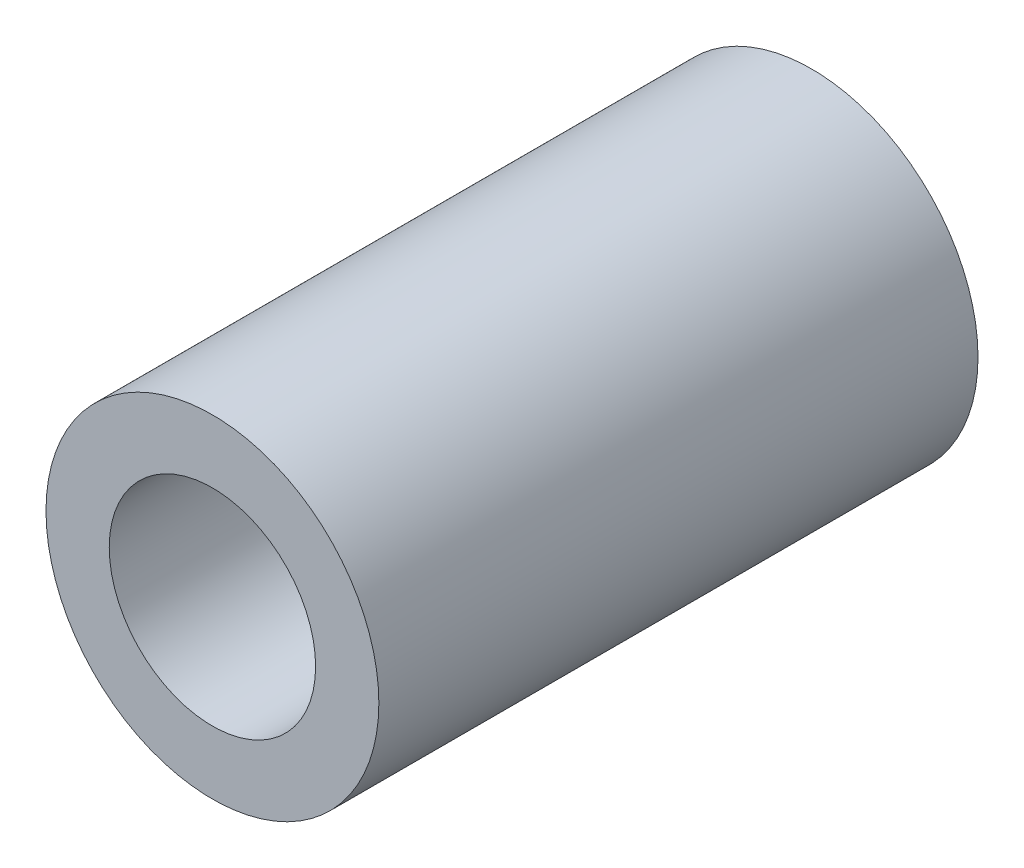
ISO-10303-21;
HEADER;
FILE_DESCRIPTION(('STEP AP214'),'2;1');
FILE_NAME('part.step','',(''),(''),'','','');
FILE_SCHEMA(('AUTOMOTIVE_DESIGN { 1 0 10303 214 1 1 1 1 }'));
ENDSEC;
DATA;
#1=APPLICATION_CONTEXT('core data for automotive mechanical design processes');
#2=APPLICATION_PROTOCOL_DEFINITION('international standard','automotive_design',2000,#1);
#3=PRODUCT_CONTEXT('',#1,'mechanical');
#4=PRODUCT('Part','Part','',(#3));
#5=PRODUCT_RELATED_PRODUCT_CATEGORY('part','',(#4));
#6=PRODUCT_DEFINITION_FORMATION('','',#4);
#7=PRODUCT_DEFINITION_CONTEXT('part definition',#1,'design');
#8=PRODUCT_DEFINITION('design','',#6,#7);
#9=PRODUCT_DEFINITION_SHAPE('','',#8);
#10=(LENGTH_UNIT() NAMED_UNIT(*) SI_UNIT(.MILLI.,.METRE.));
#11=(NAMED_UNIT(*) PLANE_ANGLE_UNIT() SI_UNIT($,.RADIAN.));
#12=(NAMED_UNIT(*) SI_UNIT($,.STERADIAN.) SOLID_ANGLE_UNIT());
#13=UNCERTAINTY_MEASURE_WITH_UNIT(LENGTH_MEASURE(1.E-05),#10,'distance_accuracy_value','');
#14=(GEOMETRIC_REPRESENTATION_CONTEXT(3) GLOBAL_UNCERTAINTY_ASSIGNED_CONTEXT((#13)) GLOBAL_UNIT_ASSIGNED_CONTEXT((#10,
#11,#12)) REPRESENTATION_CONTEXT('',''));
#15=CARTESIAN_POINT('',(0.,0.,0.));
#16=DIRECTION('',(0.,0.,1.));
#17=DIRECTION('',(1.,0.,0.));
#18=AXIS2_PLACEMENT_3D('',#15,#16,#17);
#19=CARTESIAN_POINT('',(0.,0.,9.));
#20=DIRECTION('',(0.,0.,1.));
#21=DIRECTION('',(1.,0.,0.));
#22=AXIS2_PLACEMENT_3D('',#19,#20,#21);
#23=PLANE('',#22);
#24=CARTESIAN_POINT('',(0.,0.,9.));
#25=DIRECTION('',(0.,0.,1.));
#26=DIRECTION('',(1.,0.,0.));
#27=AXIS2_PLACEMENT_3D('',#24,#25,#26);
#28=CIRCLE('',#27,2.5);
#29=CARTESIAN_POINT('',(2.5,0.,9.));
#30=VERTEX_POINT('',#29);
#31=EDGE_CURVE('E10',#30,#30,#28,.T.);
#32=ORIENTED_EDGE('',*,*,#31,.T.);
#33=EDGE_LOOP('',(#32));
#34=FACE_BOUND('',#33,.T.);
#35=CARTESIAN_POINT('',(0.,0.,9.));
#36=DIRECTION('',(0.,0.,1.));
#37=DIRECTION('',(1.,0.,0.));
#38=AXIS2_PLACEMENT_3D('',#35,#36,#37);
#39=CIRCLE('',#38,1.55);
#40=CARTESIAN_POINT('',(1.55,0.,9.));
#41=VERTEX_POINT('',#40);
#42=EDGE_CURVE('E46',#41,#41,#39,.T.);
#43=ORIENTED_EDGE('',*,*,#42,.F.);
#44=EDGE_LOOP('',(#43));
#45=FACE_BOUND('',#44,.T.);
#46=ADVANCED_FACE('F35',(#34,#45),#23,.T.);
#47=CARTESIAN_POINT('',(0.,0.,0.));
#48=DIRECTION('',(0.,0.,1.));
#49=DIRECTION('',(1.,0.,0.));
#50=AXIS2_PLACEMENT_3D('',#47,#48,#49);
#51=PLANE('',#50);
#52=CARTESIAN_POINT('',(0.,0.,0.));
#53=DIRECTION('',(0.,0.,1.));
#54=DIRECTION('',(1.,0.,0.));
#55=AXIS2_PLACEMENT_3D('',#52,#53,#54);
#56=CIRCLE('',#55,2.5);
#57=CARTESIAN_POINT('',(2.5,0.,0.));
#58=VERTEX_POINT('',#57);
#59=EDGE_CURVE('E39',#58,#58,#56,.T.);
#60=ORIENTED_EDGE('',*,*,#59,.F.);
#61=EDGE_LOOP('',(#60));
#62=FACE_BOUND('',#61,.T.);
#63=CARTESIAN_POINT('',(0.,0.,0.));
#64=DIRECTION('',(0.,0.,1.));
#65=DIRECTION('',(1.,0.,0.));
#66=AXIS2_PLACEMENT_3D('',#63,#64,#65);
#67=CIRCLE('',#66,1.55);
#68=CARTESIAN_POINT('',(1.55,0.,0.));
#69=VERTEX_POINT('',#68);
#70=EDGE_CURVE('E48',#69,#69,#67,.T.);
#71=ORIENTED_EDGE('',*,*,#70,.T.);
#72=EDGE_LOOP('',(#71));
#73=FACE_BOUND('',#72,.T.);
#74=ADVANCED_FACE('F58',(#62,#73),#51,.F.);
#75=CARTESIAN_POINT('',(0.,0.,9.));
#76=DIRECTION('',(0.,0.,-1.));
#77=DIRECTION('',(-1.,0.,0.));
#78=AXIS2_PLACEMENT_3D('',#75,#76,#77);
#79=CYLINDRICAL_SURFACE('',#78,2.5);
#80=ORIENTED_EDGE('',*,*,#31,.F.);
#81=EDGE_LOOP('',(#80));
#82=FACE_BOUND('',#81,.T.);
#83=ORIENTED_EDGE('',*,*,#59,.T.);
#84=EDGE_LOOP('',(#83));
#85=FACE_BOUND('',#84,.T.);
#86=ADVANCED_FACE('F37',(#82,#85),#79,.T.);
#87=CARTESIAN_POINT('',(0.,0.,9.));
#88=DIRECTION('',(0.,0.,-1.));
#89=DIRECTION('',(-1.,0.,0.));
#90=AXIS2_PLACEMENT_3D('',#87,#88,#89);
#91=CYLINDRICAL_SURFACE('',#90,1.55);
#92=ORIENTED_EDGE('',*,*,#42,.T.);
#93=EDGE_LOOP('',(#92));
#94=FACE_BOUND('',#93,.T.);
#95=ORIENTED_EDGE('',*,*,#70,.F.);
#96=EDGE_LOOP('',(#95));
#97=FACE_BOUND('',#96,.T.);
#98=ADVANCED_FACE('F54',(#94,#97),#91,.F.);
#99=CLOSED_SHELL('',(#46,#74,#86,#98));
#100=MANIFOLD_SOLID_BREP('B2',#99);
#101=ADVANCED_BREP_SHAPE_REPRESENTATION('',(#18,#100),#14);
#102=SHAPE_DEFINITION_REPRESENTATION(#9,#101);
ENDSEC;
END-ISO-10303-21;
